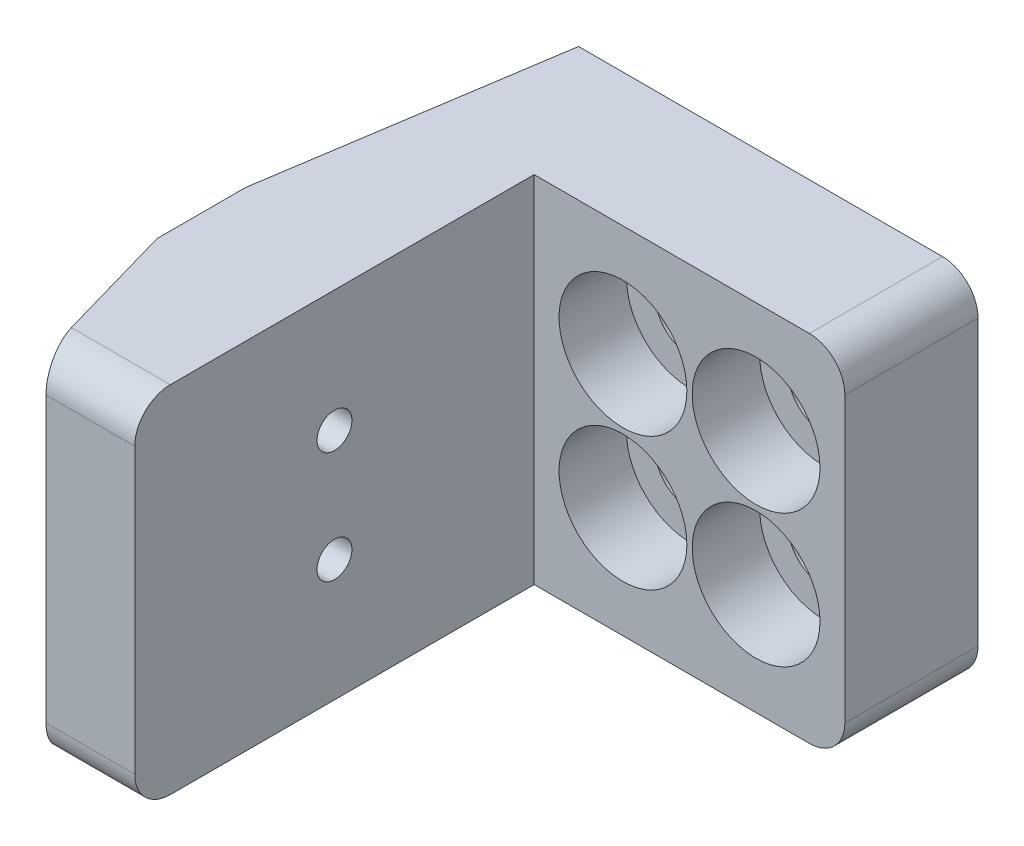
ISO-10303-21;
HEADER;
FILE_DESCRIPTION(('STEP AP214'),'2;1');
FILE_NAME('part.step','',(''),(''),'','','');
FILE_SCHEMA(('AUTOMOTIVE_DESIGN { 1 0 10303 214 1 1 1 1 }'));
ENDSEC;
DATA;
#1=APPLICATION_CONTEXT('core data for automotive mechanical design processes');
#2=APPLICATION_PROTOCOL_DEFINITION('international standard','automotive_design',2000,#1);
#3=PRODUCT_CONTEXT('',#1,'mechanical');
#4=PRODUCT('Part','Part','',(#3));
#5=PRODUCT_RELATED_PRODUCT_CATEGORY('part','',(#4));
#6=PRODUCT_DEFINITION_FORMATION('','',#4);
#7=PRODUCT_DEFINITION_CONTEXT('part definition',#1,'design');
#8=PRODUCT_DEFINITION('design','',#6,#7);
#9=PRODUCT_DEFINITION_SHAPE('','',#8);
#10=(LENGTH_UNIT() NAMED_UNIT(*) SI_UNIT(.MILLI.,.METRE.));
#11=(NAMED_UNIT(*) PLANE_ANGLE_UNIT() SI_UNIT($,.RADIAN.));
#12=(NAMED_UNIT(*) SI_UNIT($,.STERADIAN.) SOLID_ANGLE_UNIT());
#13=UNCERTAINTY_MEASURE_WITH_UNIT(LENGTH_MEASURE(1.E-05),#10,'distance_accuracy_value','');
#14=(GEOMETRIC_REPRESENTATION_CONTEXT(3) GLOBAL_UNCERTAINTY_ASSIGNED_CONTEXT((#13)) GLOBAL_UNIT_ASSIGNED_CONTEXT((#10,
#11,#12)) REPRESENTATION_CONTEXT('',''));
#15=CARTESIAN_POINT('',(0.,0.,0.));
#16=DIRECTION('',(0.,0.,1.));
#17=DIRECTION('',(1.,0.,0.));
#18=AXIS2_PLACEMENT_3D('',#15,#16,#17);
#19=CARTESIAN_POINT('',(0.,25.4,28.575));
#20=DIRECTION('',(-1.,0.,0.));
#21=DIRECTION('',(0.,0.,1.));
#22=AXIS2_PLACEMENT_3D('',#19,#20,#21);
#23=PLANE('',#22);
#24=CARTESIAN_POINT('',(0.,16.7,14.2875));
#25=DIRECTION('',(1.,0.,0.));
#26=DIRECTION('',(0.,0.,-1.));
#27=AXIS2_PLACEMENT_3D('',#24,#25,#26);
#28=CIRCLE('',#27,1.25);
#29=CARTESIAN_POINT('',(0.,16.7,13.0375));
#30=VERTEX_POINT('',#29);
#31=EDGE_CURVE('E374',#30,#30,#28,.T.);
#32=ORIENTED_EDGE('',*,*,#31,.F.);
#33=EDGE_LOOP('',(#32));
#34=FACE_BOUND('',#33,.T.);
#35=CARTESIAN_POINT('',(0.,8.7,14.2875));
#36=DIRECTION('',(1.,0.,0.));
#37=DIRECTION('',(0.,0.,-1.));
#38=AXIS2_PLACEMENT_3D('',#35,#36,#37);
#39=CIRCLE('',#38,1.25);
#40=CARTESIAN_POINT('',(0.,8.7,13.0375));
#41=VERTEX_POINT('',#40);
#42=EDGE_CURVE('E368',#41,#41,#39,.T.);
#43=ORIENTED_EDGE('',*,*,#42,.F.);
#44=EDGE_LOOP('',(#43));
#45=FACE_BOUND('',#44,.T.);
#46=DIRECTION('',(0.,-1.,0.));
#47=VECTOR('',#46,1.);
#48=CARTESIAN_POINT('',(0.,25.4,28.575));
#49=LINE('',#48,#47);
#50=CARTESIAN_POINT('',(0.,22.86,28.575));
#51=VERTEX_POINT('',#50);
#52=CARTESIAN_POINT('',(0.,2.54,28.575));
#53=VERTEX_POINT('',#52);
#54=EDGE_CURVE('E226',#51,#53,#49,.T.);
#55=ORIENTED_EDGE('',*,*,#54,.T.);
#56=CARTESIAN_POINT('',(0.,2.54,26.035));
#57=DIRECTION('',(-1.,0.,0.));
#58=DIRECTION('',(0.,0.,1.));
#59=AXIS2_PLACEMENT_3D('',#56,#57,#58);
#60=CIRCLE('',#59,2.54);
#61=CARTESIAN_POINT('',(0.,0.,26.035));
#62=VERTEX_POINT('',#61);
#63=EDGE_CURVE('E175',#53,#62,#60,.F.);
#64=ORIENTED_EDGE('',*,*,#63,.T.);
#65=DIRECTION('',(0.,0.,-1.));
#66=VECTOR('',#65,1.);
#67=CARTESIAN_POINT('',(0.,0.,28.575));
#68=LINE('',#67,#66);
#69=CARTESIAN_POINT('',(0.,0.,0.));
#70=VERTEX_POINT('',#69);
#71=EDGE_CURVE('E160',#62,#70,#68,.T.);
#72=ORIENTED_EDGE('',*,*,#71,.T.);
#73=DIRECTION('',(0.,-1.,0.));
#74=VECTOR('',#73,1.);
#75=CARTESIAN_POINT('',(0.,25.4,0.));
#76=LINE('',#75,#74);
#77=CARTESIAN_POINT('',(0.,25.4,0.));
#78=VERTEX_POINT('',#77);
#79=EDGE_CURVE('E154',#78,#70,#76,.T.);
#80=ORIENTED_EDGE('',*,*,#79,.F.);
#81=DIRECTION('',(0.,0.,-1.));
#82=VECTOR('',#81,1.);
#83=CARTESIAN_POINT('',(0.,25.4,28.575));
#84=LINE('',#83,#82);
#85=CARTESIAN_POINT('',(0.,25.4,26.035));
#86=VERTEX_POINT('',#85);
#87=EDGE_CURVE('E139',#86,#78,#84,.T.);
#88=ORIENTED_EDGE('',*,*,#87,.F.);
#89=CARTESIAN_POINT('',(0.,22.86,26.035));
#90=DIRECTION('',(-1.,0.,0.));
#91=DIRECTION('',(0.,0.,1.));
#92=AXIS2_PLACEMENT_3D('',#89,#90,#91);
#93=CIRCLE('',#92,2.54);
#94=EDGE_CURVE('E173',#86,#51,#93,.F.);
#95=ORIENTED_EDGE('',*,*,#94,.T.);
#96=EDGE_LOOP('',(#55,#64,#72,#80,#88,#95));
#97=FACE_BOUND('',#96,.T.);
#98=ADVANCED_FACE('F49',(#34,#45,#97),#23,.F.);
#99=CARTESIAN_POINT('',(0.,25.4,0.));
#100=DIRECTION('',(0.,0.,-1.));
#101=DIRECTION('',(-1.,0.,0.));
#102=AXIS2_PLACEMENT_3D('',#99,#100,#101);
#103=PLANE('',#102);
#104=CARTESIAN_POINT('',(6.35,17.4625,0.));
#105=DIRECTION('',(0.,0.,1.));
#106=DIRECTION('',(1.,0.,0.));
#107=AXIS2_PLACEMENT_3D('',#104,#105,#106);
#108=CIRCLE('',#107,4.572);
#109=CARTESIAN_POINT('',(10.922,17.4625,0.));
#110=VERTEX_POINT('',#109);
#111=EDGE_CURVE('E371',#110,#110,#108,.T.);
#112=ORIENTED_EDGE('',*,*,#111,.F.);
#113=EDGE_LOOP('',(#112));
#114=FACE_BOUND('',#113,.T.);
#115=CARTESIAN_POINT('',(15.875,7.9375,0.));
#116=DIRECTION('',(0.,0.,1.));
#117=DIRECTION('',(1.,0.,0.));
#118=AXIS2_PLACEMENT_3D('',#115,#116,#117);
#119=CIRCLE('',#118,4.572);
#120=CARTESIAN_POINT('',(20.447,7.9375,0.));
#121=VERTEX_POINT('',#120);
#122=EDGE_CURVE('E389',#121,#121,#119,.T.);
#123=ORIENTED_EDGE('',*,*,#122,.F.);
#124=EDGE_LOOP('',(#123));
#125=FACE_BOUND('',#124,.T.);
#126=CARTESIAN_POINT('',(6.35,7.9375,0.));
#127=DIRECTION('',(0.,0.,1.));
#128=DIRECTION('',(1.,0.,0.));
#129=AXIS2_PLACEMENT_3D('',#126,#127,#128);
#130=CIRCLE('',#129,4.572);
#131=CARTESIAN_POINT('',(10.922,7.9375,0.));
#132=VERTEX_POINT('',#131);
#133=EDGE_CURVE('E401',#132,#132,#130,.T.);
#134=ORIENTED_EDGE('',*,*,#133,.F.);
#135=EDGE_LOOP('',(#134));
#136=FACE_BOUND('',#135,.T.);
#137=CARTESIAN_POINT('',(15.875,17.4625,0.));
#138=DIRECTION('',(0.,0.,1.));
#139=DIRECTION('',(1.,0.,0.));
#140=AXIS2_PLACEMENT_3D('',#137,#138,#139);
#141=CIRCLE('',#140,4.572);
#142=CARTESIAN_POINT('',(20.447,17.4625,0.));
#143=VERTEX_POINT('',#142);
#144=EDGE_CURVE('E413',#143,#143,#141,.T.);
#145=ORIENTED_EDGE('',*,*,#144,.F.);
#146=EDGE_LOOP('',(#145));
#147=FACE_BOUND('',#146,.T.);
#148=DIRECTION('',(1.,0.,0.));
#149=VECTOR('',#148,1.);
#150=CARTESIAN_POINT('',(0.,0.,0.));
#151=LINE('',#150,#149);
#152=CARTESIAN_POINT('',(19.685,0.,0.));
#153=VERTEX_POINT('',#152);
#154=EDGE_CURVE('E210',#70,#153,#151,.T.);
#155=ORIENTED_EDGE('',*,*,#154,.T.);
#156=CARTESIAN_POINT('',(19.685,2.54,0.));
#157=DIRECTION('',(0.,0.,-1.));
#158=DIRECTION('',(-1.,0.,0.));
#159=AXIS2_PLACEMENT_3D('',#156,#157,#158);
#160=CIRCLE('',#159,2.54);
#161=CARTESIAN_POINT('',(22.225,2.54,0.));
#162=VERTEX_POINT('',#161);
#163=EDGE_CURVE('E11',#153,#162,#160,.F.);
#164=ORIENTED_EDGE('',*,*,#163,.T.);
#165=DIRECTION('',(0.,-1.,0.));
#166=VECTOR('',#165,1.);
#167=CARTESIAN_POINT('',(22.225,25.4,0.));
#168=LINE('',#167,#166);
#169=CARTESIAN_POINT('',(22.225,22.86,0.));
#170=VERTEX_POINT('',#169);
#171=EDGE_CURVE('E163',#170,#162,#168,.T.);
#172=ORIENTED_EDGE('',*,*,#171,.F.);
#173=CARTESIAN_POINT('',(19.685,22.86,0.));
#174=DIRECTION('',(0.,0.,-1.));
#175=DIRECTION('',(-1.,0.,0.));
#176=AXIS2_PLACEMENT_3D('',#173,#174,#175);
#177=CIRCLE('',#176,2.54);
#178=CARTESIAN_POINT('',(19.685,25.4,0.));
#179=VERTEX_POINT('',#178);
#180=EDGE_CURVE('E57',#170,#179,#177,.F.);
#181=ORIENTED_EDGE('',*,*,#180,.T.);
#182=DIRECTION('',(1.,0.,0.));
#183=VECTOR('',#182,1.);
#184=CARTESIAN_POINT('',(0.,25.4,0.));
#185=LINE('',#184,#183);
#186=EDGE_CURVE('E144',#78,#179,#185,.T.);
#187=ORIENTED_EDGE('',*,*,#186,.F.);
#188=ORIENTED_EDGE('',*,*,#79,.T.);
#189=EDGE_LOOP('',(#155,#164,#172,#181,#187,#188));
#190=FACE_BOUND('',#189,.T.);
#191=ADVANCED_FACE('F153',(#114,#125,#136,#147,#190),#103,.F.);
#192=CARTESIAN_POINT('',(22.225,25.4,0.));
#193=DIRECTION('',(-1.,0.,0.));
#194=DIRECTION('',(0.,0.,1.));
#195=AXIS2_PLACEMENT_3D('',#192,#193,#194);
#196=PLANE('',#195);
#197=ORIENTED_EDGE('',*,*,#171,.T.);
#198=DIRECTION('',(0.,0.,-1.));
#199=VECTOR('',#198,1.);
#200=CARTESIAN_POINT('',(22.225,2.54,-9.525));
#201=LINE('',#200,#199);
#202=CARTESIAN_POINT('',(22.225,2.54,-9.525));
#203=VERTEX_POINT('',#202);
#204=EDGE_CURVE('E189',#162,#203,#201,.T.);
#205=ORIENTED_EDGE('',*,*,#204,.T.);
#206=DIRECTION('',(0.,-1.,0.));
#207=VECTOR('',#206,1.);
#208=CARTESIAN_POINT('',(22.225,25.4,-9.525));
#209=LINE('',#208,#207);
#210=CARTESIAN_POINT('',(22.225,22.86,-9.525));
#211=VERTEX_POINT('',#210);
#212=EDGE_CURVE('E167',#211,#203,#209,.T.);
#213=ORIENTED_EDGE('',*,*,#212,.F.);
#214=DIRECTION('',(0.,0.,-1.));
#215=VECTOR('',#214,1.);
#216=CARTESIAN_POINT('',(22.225,22.86,0.));
#217=LINE('',#216,#215);
#218=EDGE_CURVE('E69',#211,#170,#217,.F.);
#219=ORIENTED_EDGE('',*,*,#218,.T.);
#220=EDGE_LOOP('',(#197,#205,#213,#219));
#221=FACE_BOUND('',#220,.T.);
#222=ADVANCED_FACE('F213',(#221),#196,.F.);
#223=CARTESIAN_POINT('',(22.225,25.4,-9.525));
#224=DIRECTION('',(0.,0.,1.));
#225=DIRECTION('',(1.,0.,0.));
#226=AXIS2_PLACEMENT_3D('',#223,#224,#225);
#227=PLANE('',#226);
#228=CARTESIAN_POINT('',(6.35,17.4625,-9.525));
#229=DIRECTION('',(0.,0.,1.));
#230=DIRECTION('',(1.,0.,0.));
#231=AXIS2_PLACEMENT_3D('',#228,#229,#230);
#232=CIRCLE('',#231,2.5527);
#233=CARTESIAN_POINT('',(8.9027,17.4625,-9.525));
#234=VERTEX_POINT('',#233);
#235=EDGE_CURVE('E386',#234,#234,#232,.T.);
#236=ORIENTED_EDGE('',*,*,#235,.T.);
#237=EDGE_LOOP('',(#236));
#238=FACE_BOUND('',#237,.T.);
#239=CARTESIAN_POINT('',(15.875,7.9375,-9.525));
#240=DIRECTION('',(0.,0.,1.));
#241=DIRECTION('',(1.,0.,0.));
#242=AXIS2_PLACEMENT_3D('',#239,#240,#241);
#243=CIRCLE('',#242,2.5527);
#244=CARTESIAN_POINT('',(18.4277,7.9375,-9.525));
#245=VERTEX_POINT('',#244);
#246=EDGE_CURVE('E398',#245,#245,#243,.T.);
#247=ORIENTED_EDGE('',*,*,#246,.T.);
#248=EDGE_LOOP('',(#247));
#249=FACE_BOUND('',#248,.T.);
#250=CARTESIAN_POINT('',(6.35,7.9375,-9.525));
#251=DIRECTION('',(0.,0.,1.));
#252=DIRECTION('',(1.,0.,0.));
#253=AXIS2_PLACEMENT_3D('',#250,#251,#252);
#254=CIRCLE('',#253,2.5527);
#255=CARTESIAN_POINT('',(8.9027,7.9375,-9.525));
#256=VERTEX_POINT('',#255);
#257=EDGE_CURVE('E410',#256,#256,#254,.T.);
#258=ORIENTED_EDGE('',*,*,#257,.T.);
#259=EDGE_LOOP('',(#258));
#260=FACE_BOUND('',#259,.T.);
#261=CARTESIAN_POINT('',(15.875,17.4625,-9.525));
#262=DIRECTION('',(0.,0.,1.));
#263=DIRECTION('',(1.,0.,0.));
#264=AXIS2_PLACEMENT_3D('',#261,#262,#263);
#265=CIRCLE('',#264,2.5527);
#266=CARTESIAN_POINT('',(18.4277,17.4625,-9.525));
#267=VERTEX_POINT('',#266);
#268=EDGE_CURVE('E228',#267,#267,#265,.T.);
#269=ORIENTED_EDGE('',*,*,#268,.T.);
#270=EDGE_LOOP('',(#269));
#271=FACE_BOUND('',#270,.T.);
#272=ORIENTED_EDGE('',*,*,#212,.T.);
#273=CARTESIAN_POINT('',(19.685,2.54,-9.525));
#274=DIRECTION('',(0.,0.,1.));
#275=DIRECTION('',(1.,0.,0.));
#276=AXIS2_PLACEMENT_3D('',#273,#274,#275);
#277=CIRCLE('',#276,2.54);
#278=CARTESIAN_POINT('',(19.685,0.,-9.525));
#279=VERTEX_POINT('',#278);
#280=EDGE_CURVE('E194',#203,#279,#277,.F.);
#281=ORIENTED_EDGE('',*,*,#280,.T.);
#282=DIRECTION('',(-1.,0.,0.));
#283=VECTOR('',#282,1.);
#284=CARTESIAN_POINT('',(22.225,0.,-9.525));
#285=LINE('',#284,#283);
#286=CARTESIAN_POINT('',(-6.35,0.,-9.525));
#287=VERTEX_POINT('',#286);
#288=EDGE_CURVE('E200',#279,#287,#285,.T.);
#289=ORIENTED_EDGE('',*,*,#288,.T.);
#290=DIRECTION('',(0.,-1.,0.));
#291=VECTOR('',#290,1.);
#292=CARTESIAN_POINT('',(-6.35,25.4,-9.525));
#293=LINE('',#292,#291);
#294=CARTESIAN_POINT('',(-6.35,25.4,-9.525));
#295=VERTEX_POINT('',#294);
#296=EDGE_CURVE('E216',#295,#287,#293,.T.);
#297=ORIENTED_EDGE('',*,*,#296,.F.);
#298=DIRECTION('',(-1.,0.,0.));
#299=VECTOR('',#298,1.);
#300=CARTESIAN_POINT('',(22.225,25.4,-9.525));
#301=LINE('',#300,#299);
#302=CARTESIAN_POINT('',(19.685,25.4,-9.525));
#303=VERTEX_POINT('',#302);
#304=EDGE_CURVE('E156',#303,#295,#301,.T.);
#305=ORIENTED_EDGE('',*,*,#304,.F.);
#306=CARTESIAN_POINT('',(19.685,22.86,-9.525));
#307=DIRECTION('',(0.,0.,1.));
#308=DIRECTION('',(1.,0.,0.));
#309=AXIS2_PLACEMENT_3D('',#306,#307,#308);
#310=CIRCLE('',#309,2.54);
#311=EDGE_CURVE('E192',#303,#211,#310,.F.);
#312=ORIENTED_EDGE('',*,*,#311,.T.);
#313=EDGE_LOOP('',(#272,#281,#289,#297,#305,#312));
#314=FACE_BOUND('',#313,.T.);
#315=ADVANCED_FACE('F198',(#238,#249,#260,#271,#314),#227,.F.);
#316=CARTESIAN_POINT('',(-9.525,25.4,11.1125));
#317=DIRECTION('',(0.988371697650617,0.,0.152057184253941));
#318=DIRECTION('',(0.152057184253941,0.,-0.988371697650617));
#319=AXIS2_PLACEMENT_3D('',#316,#317,#318);
#320=PLANE('',#319);
#321=DIRECTION('',(-0.152057184253941,0.,0.988371697650617));
#322=VECTOR('',#321,1.);
#323=CARTESIAN_POINT('',(-9.525,0.,11.1125));
#324=LINE('',#323,#322);
#325=CARTESIAN_POINT('',(-9.525,0.,11.1125));
#326=VERTEX_POINT('',#325);
#327=EDGE_CURVE('E209',#287,#326,#324,.T.);
#328=ORIENTED_EDGE('',*,*,#327,.T.);
#329=DIRECTION('',(0.,-1.,0.));
#330=VECTOR('',#329,1.);
#331=CARTESIAN_POINT('',(-9.525,25.4,11.1125));
#332=LINE('',#331,#330);
#333=CARTESIAN_POINT('',(-9.525,25.4,11.1125));
#334=VERTEX_POINT('',#333);
#335=EDGE_CURVE('E242',#334,#326,#332,.T.);
#336=ORIENTED_EDGE('',*,*,#335,.F.);
#337=DIRECTION('',(-0.152057184253941,0.,0.988371697650617));
#338=VECTOR('',#337,1.);
#339=CARTESIAN_POINT('',(-9.525,25.4,11.1125));
#340=LINE('',#339,#338);
#341=EDGE_CURVE('E218',#295,#334,#340,.T.);
#342=ORIENTED_EDGE('',*,*,#341,.F.);
#343=ORIENTED_EDGE('',*,*,#296,.T.);
#344=EDGE_LOOP('',(#328,#336,#342,#343));
#345=FACE_BOUND('',#344,.T.);
#346=ADVANCED_FACE('F246',(#345),#320,.F.);
#347=CARTESIAN_POINT('',(-9.525,25.4,11.1125));
#348=DIRECTION('',(1.,0.,0.));
#349=DIRECTION('',(0.,0.,-1.));
#350=AXIS2_PLACEMENT_3D('',#347,#348,#349);
#351=PLANE('',#350);
#352=CARTESIAN_POINT('',(-9.525,16.7,14.2875));
#353=DIRECTION('',(1.,0.,0.));
#354=DIRECTION('',(0.,0.,-1.));
#355=AXIS2_PLACEMENT_3D('',#352,#353,#354);
#356=CIRCLE('',#355,1.25);
#357=CARTESIAN_POINT('',(-9.525,16.7,13.0375));
#358=VERTEX_POINT('',#357);
#359=EDGE_CURVE('E369',#358,#358,#356,.T.);
#360=ORIENTED_EDGE('',*,*,#359,.T.);
#361=EDGE_LOOP('',(#360));
#362=FACE_BOUND('',#361,.T.);
#363=CARTESIAN_POINT('',(-9.525,8.7,14.2875));
#364=DIRECTION('',(1.,0.,0.));
#365=DIRECTION('',(0.,0.,-1.));
#366=AXIS2_PLACEMENT_3D('',#363,#364,#365);
#367=CIRCLE('',#366,1.25);
#368=CARTESIAN_POINT('',(-9.525,8.7,13.0375));
#369=VERTEX_POINT('',#368);
#370=EDGE_CURVE('E365',#369,#369,#367,.T.);
#371=ORIENTED_EDGE('',*,*,#370,.T.);
#372=EDGE_LOOP('',(#371));
#373=FACE_BOUND('',#372,.T.);
#374=DIRECTION('',(0.,0.,1.));
#375=VECTOR('',#374,1.);
#376=CARTESIAN_POINT('',(-9.525,0.,11.1125));
#377=LINE('',#376,#375);
#378=CARTESIAN_POINT('',(-9.525,0.,17.4625));
#379=VERTEX_POINT('',#378);
#380=EDGE_CURVE('E231',#326,#379,#377,.T.);
#381=ORIENTED_EDGE('',*,*,#380,.T.);
#382=DIRECTION('',(0.,-1.,0.));
#383=VECTOR('',#382,1.);
#384=CARTESIAN_POINT('',(-9.525,25.4,17.4625));
#385=LINE('',#384,#383);
#386=CARTESIAN_POINT('',(-9.525,25.4,17.4625));
#387=VERTEX_POINT('',#386);
#388=EDGE_CURVE('E239',#387,#379,#385,.T.);
#389=ORIENTED_EDGE('',*,*,#388,.F.);
#390=DIRECTION('',(0.,0.,1.));
#391=VECTOR('',#390,1.);
#392=CARTESIAN_POINT('',(-9.525,25.4,11.1125));
#393=LINE('',#392,#391);
#394=EDGE_CURVE('E220',#334,#387,#393,.T.);
#395=ORIENTED_EDGE('',*,*,#394,.F.);
#396=ORIENTED_EDGE('',*,*,#335,.T.);
#397=EDGE_LOOP('',(#381,#389,#395,#396));
#398=FACE_BOUND('',#397,.T.);
#399=ADVANCED_FACE('F252',(#362,#373,#398),#351,.F.);
#400=CARTESIAN_POINT('',(-9.525,25.4,17.4625));
#401=DIRECTION('',(0.961523947640823,0.,-0.274721127897378));
#402=DIRECTION('',(-0.274721127897378,0.,-0.961523947640823));
#403=AXIS2_PLACEMENT_3D('',#400,#401,#402);
#404=PLANE('',#403);
#405=DIRECTION('',(0.274721127897378,0.,0.961523947640823));
#406=VECTOR('',#405,1.);
#407=CARTESIAN_POINT('',(-9.525,0.,17.4625));
#408=LINE('',#407,#406);
#409=CARTESIAN_POINT('',(-7.07571428571428,0.,26.035));
#410=VERTEX_POINT('',#409);
#411=EDGE_CURVE('E150',#379,#410,#408,.T.);
#412=ORIENTED_EDGE('',*,*,#411,.T.);
#413=CARTESIAN_POINT('',(-7.07571428571428,2.54,26.035));
#414=DIRECTION('',(0.961523947640823,0.,-0.274721127897378));
#415=DIRECTION('',(-0.274721127897378,0.,-0.961523947640823));
#416=AXIS2_PLACEMENT_3D('',#413,#414,#415);
#417=ELLIPSE('',#416,2.64163987411036,2.54);
#418=CARTESIAN_POINT('',(-6.35,2.54,28.575));
#419=VERTEX_POINT('',#418);
#420=EDGE_CURVE('E183',#410,#419,#417,.F.);
#421=ORIENTED_EDGE('',*,*,#420,.T.);
#422=DIRECTION('',(0.,-1.,0.));
#423=VECTOR('',#422,1.);
#424=CARTESIAN_POINT('',(-6.35,25.4,28.575));
#425=LINE('',#424,#423);
#426=CARTESIAN_POINT('',(-6.35,22.86,28.575));
#427=VERTEX_POINT('',#426);
#428=EDGE_CURVE('E236',#427,#419,#425,.T.);
#429=ORIENTED_EDGE('',*,*,#428,.F.);
#430=CARTESIAN_POINT('',(-7.07571428571428,22.86,26.035));
#431=DIRECTION('',(0.961523947640823,0.,-0.274721127897378));
#432=DIRECTION('',(0.274721127897378,0.,0.961523947640823));
#433=AXIS2_PLACEMENT_3D('',#430,#431,#432);
#434=ELLIPSE('',#433,2.64163987411036,2.54);
#435=CARTESIAN_POINT('',(-7.07571428571428,25.4,26.035));
#436=VERTEX_POINT('',#435);
#437=EDGE_CURVE('E181',#427,#436,#434,.F.);
#438=ORIENTED_EDGE('',*,*,#437,.T.);
#439=DIRECTION('',(0.274721127897378,0.,0.961523947640823));
#440=VECTOR('',#439,1.);
#441=CARTESIAN_POINT('',(-9.525,25.4,17.4625));
#442=LINE('',#441,#440);
#443=EDGE_CURVE('E224',#387,#436,#442,.T.);
#444=ORIENTED_EDGE('',*,*,#443,.F.);
#445=ORIENTED_EDGE('',*,*,#388,.T.);
#446=EDGE_LOOP('',(#412,#421,#429,#438,#444,#445));
#447=FACE_BOUND('',#446,.T.);
#448=ADVANCED_FACE('F255',(#447),#404,.F.);
#449=CARTESIAN_POINT('',(-6.35,25.4,28.575));
#450=DIRECTION('',(0.,0.,-1.));
#451=DIRECTION('',(-1.,0.,0.));
#452=AXIS2_PLACEMENT_3D('',#449,#450,#451);
#453=PLANE('',#452);
#454=ORIENTED_EDGE('',*,*,#428,.T.);
#455=DIRECTION('',(1.,0.,0.));
#456=VECTOR('',#455,1.);
#457=CARTESIAN_POINT('',(0.,2.54,28.575));
#458=LINE('',#457,#456);
#459=EDGE_CURVE('E165',#419,#53,#458,.T.);
#460=ORIENTED_EDGE('',*,*,#459,.T.);
#461=ORIENTED_EDGE('',*,*,#54,.F.);
#462=DIRECTION('',(1.,0.,0.));
#463=VECTOR('',#462,1.);
#464=CARTESIAN_POINT('',(-6.35,22.86,28.575));
#465=LINE('',#464,#463);
#466=EDGE_CURVE('E162',#51,#427,#465,.F.);
#467=ORIENTED_EDGE('',*,*,#466,.T.);
#468=EDGE_LOOP('',(#454,#460,#461,#467));
#469=FACE_BOUND('',#468,.T.);
#470=ADVANCED_FACE('F263',(#469),#453,.F.);
#471=CARTESIAN_POINT('',(0.,25.4,0.));
#472=DIRECTION('',(0.,-1.,0.));
#473=DIRECTION('',(0.,0.,-1.));
#474=AXIS2_PLACEMENT_3D('',#471,#472,#473);
#475=PLANE('',#474);
#476=ORIENTED_EDGE('',*,*,#443,.T.);
#477=DIRECTION('',(1.,0.,0.));
#478=VECTOR('',#477,1.);
#479=CARTESIAN_POINT('',(0.,25.4,26.035));
#480=LINE('',#479,#478);
#481=EDGE_CURVE('E147',#436,#86,#480,.T.);
#482=ORIENTED_EDGE('',*,*,#481,.T.);
#483=ORIENTED_EDGE('',*,*,#87,.T.);
#484=ORIENTED_EDGE('',*,*,#186,.T.);
#485=DIRECTION('',(0.,0.,-1.));
#486=VECTOR('',#485,1.);
#487=CARTESIAN_POINT('',(19.685,25.4,0.));
#488=LINE('',#487,#486);
#489=EDGE_CURVE('E185',#179,#303,#488,.T.);
#490=ORIENTED_EDGE('',*,*,#489,.T.);
#491=ORIENTED_EDGE('',*,*,#304,.T.);
#492=ORIENTED_EDGE('',*,*,#341,.T.);
#493=ORIENTED_EDGE('',*,*,#394,.T.);
#494=EDGE_LOOP('',(#476,#482,#483,#484,#490,#491,#492,#493));
#495=FACE_BOUND('',#494,.T.);
#496=ADVANCED_FACE('F142',(#495),#475,.F.);
#497=CARTESIAN_POINT('',(0.,0.,0.));
#498=DIRECTION('',(0.,-1.,0.));
#499=DIRECTION('',(0.,0.,-1.));
#500=AXIS2_PLACEMENT_3D('',#497,#498,#499);
#501=PLANE('',#500);
#502=ORIENTED_EDGE('',*,*,#71,.F.);
#503=DIRECTION('',(1.,0.,0.));
#504=VECTOR('',#503,1.);
#505=CARTESIAN_POINT('',(-6.35,0.,26.035));
#506=LINE('',#505,#504);
#507=EDGE_CURVE('E179',#62,#410,#506,.F.);
#508=ORIENTED_EDGE('',*,*,#507,.T.);
#509=ORIENTED_EDGE('',*,*,#411,.F.);
#510=ORIENTED_EDGE('',*,*,#380,.F.);
#511=ORIENTED_EDGE('',*,*,#327,.F.);
#512=ORIENTED_EDGE('',*,*,#288,.F.);
#513=DIRECTION('',(0.,0.,-1.));
#514=VECTOR('',#513,1.);
#515=CARTESIAN_POINT('',(19.685,0.,0.));
#516=LINE('',#515,#514);
#517=EDGE_CURVE('E177',#279,#153,#516,.F.);
#518=ORIENTED_EDGE('',*,*,#517,.T.);
#519=ORIENTED_EDGE('',*,*,#154,.F.);
#520=EDGE_LOOP('',(#502,#508,#509,#510,#511,#512,#518,#519));
#521=FACE_BOUND('',#520,.T.);
#522=ADVANCED_FACE('F207',(#521),#501,.T.);
#523=CARTESIAN_POINT('',(15.875,17.4625,0.));
#524=DIRECTION('',(0.,0.,1.));
#525=DIRECTION('',(1.,0.,0.));
#526=AXIS2_PLACEMENT_3D('',#523,#524,#525);
#527=CYLINDRICAL_SURFACE('',#526,2.5527);
#528=ORIENTED_EDGE('',*,*,#268,.F.);
#529=EDGE_LOOP('',(#528));
#530=FACE_BOUND('',#529,.T.);
#531=CARTESIAN_POINT('',(15.875,17.4625,-4.826));
#532=DIRECTION('',(0.,0.,1.));
#533=DIRECTION('',(1.,0.,0.));
#534=AXIS2_PLACEMENT_3D('',#531,#532,#533);
#535=CIRCLE('',#534,2.5527);
#536=CARTESIAN_POINT('',(18.4277,17.4625,-4.826));
#537=VERTEX_POINT('',#536);
#538=EDGE_CURVE('E419',#537,#537,#535,.T.);
#539=ORIENTED_EDGE('',*,*,#538,.T.);
#540=EDGE_LOOP('',(#539));
#541=FACE_BOUND('',#540,.T.);
#542=ADVANCED_FACE('F308',(#530,#541),#527,.F.);
#543=CARTESIAN_POINT('',(18.4277,17.4625,-4.826));
#544=DIRECTION('',(0.,0.,-1.));
#545=DIRECTION('',(-1.,0.,0.));
#546=AXIS2_PLACEMENT_3D('',#543,#544,#545);
#547=PLANE('',#546);
#548=ORIENTED_EDGE('',*,*,#538,.F.);
#549=EDGE_LOOP('',(#548));
#550=FACE_BOUND('',#549,.T.);
#551=CARTESIAN_POINT('',(15.875,17.4625,-4.826));
#552=DIRECTION('',(0.,0.,1.));
#553=DIRECTION('',(1.,0.,0.));
#554=AXIS2_PLACEMENT_3D('',#551,#552,#553);
#555=CIRCLE('',#554,4.572);
#556=CARTESIAN_POINT('',(20.447,17.4625,-4.826));
#557=VERTEX_POINT('',#556);
#558=EDGE_CURVE('E416',#557,#557,#555,.T.);
#559=ORIENTED_EDGE('',*,*,#558,.T.);
#560=EDGE_LOOP('',(#559));
#561=FACE_BOUND('',#560,.T.);
#562=ADVANCED_FACE('F313',(#550,#561),#547,.F.);
#563=CARTESIAN_POINT('',(15.875,17.4625,0.));
#564=DIRECTION('',(0.,0.,1.));
#565=DIRECTION('',(1.,0.,0.));
#566=AXIS2_PLACEMENT_3D('',#563,#564,#565);
#567=CYLINDRICAL_SURFACE('',#566,4.572);
#568=ORIENTED_EDGE('',*,*,#558,.F.);
#569=EDGE_LOOP('',(#568));
#570=FACE_BOUND('',#569,.T.);
#571=ORIENTED_EDGE('',*,*,#144,.T.);
#572=EDGE_LOOP('',(#571));
#573=FACE_BOUND('',#572,.T.);
#574=ADVANCED_FACE('F317',(#570,#573),#567,.F.);
#575=CARTESIAN_POINT('',(6.35,7.9375,0.));
#576=DIRECTION('',(0.,0.,1.));
#577=DIRECTION('',(1.,0.,0.));
#578=AXIS2_PLACEMENT_3D('',#575,#576,#577);
#579=CYLINDRICAL_SURFACE('',#578,2.5527);
#580=ORIENTED_EDGE('',*,*,#257,.F.);
#581=EDGE_LOOP('',(#580));
#582=FACE_BOUND('',#581,.T.);
#583=CARTESIAN_POINT('',(6.35,7.9375,-4.826));
#584=DIRECTION('',(0.,0.,1.));
#585=DIRECTION('',(1.,0.,0.));
#586=AXIS2_PLACEMENT_3D('',#583,#584,#585);
#587=CIRCLE('',#586,2.5527);
#588=CARTESIAN_POINT('',(8.9027,7.9375,-4.826));
#589=VERTEX_POINT('',#588);
#590=EDGE_CURVE('E407',#589,#589,#587,.T.);
#591=ORIENTED_EDGE('',*,*,#590,.T.);
#592=EDGE_LOOP('',(#591));
#593=FACE_BOUND('',#592,.T.);
#594=ADVANCED_FACE('F321',(#582,#593),#579,.F.);
#595=CARTESIAN_POINT('',(8.9027,7.9375,-4.826));
#596=DIRECTION('',(0.,0.,-1.));
#597=DIRECTION('',(-1.,0.,0.));
#598=AXIS2_PLACEMENT_3D('',#595,#596,#597);
#599=PLANE('',#598);
#600=ORIENTED_EDGE('',*,*,#590,.F.);
#601=EDGE_LOOP('',(#600));
#602=FACE_BOUND('',#601,.T.);
#603=CARTESIAN_POINT('',(6.35,7.9375,-4.826));
#604=DIRECTION('',(0.,0.,1.));
#605=DIRECTION('',(1.,0.,0.));
#606=AXIS2_PLACEMENT_3D('',#603,#604,#605);
#607=CIRCLE('',#606,4.572);
#608=CARTESIAN_POINT('',(10.922,7.9375,-4.826));
#609=VERTEX_POINT('',#608);
#610=EDGE_CURVE('E404',#609,#609,#607,.T.);
#611=ORIENTED_EDGE('',*,*,#610,.T.);
#612=EDGE_LOOP('',(#611));
#613=FACE_BOUND('',#612,.T.);
#614=ADVANCED_FACE('F325',(#602,#613),#599,.F.);
#615=CARTESIAN_POINT('',(6.35,7.9375,0.));
#616=DIRECTION('',(0.,0.,1.));
#617=DIRECTION('',(1.,0.,0.));
#618=AXIS2_PLACEMENT_3D('',#615,#616,#617);
#619=CYLINDRICAL_SURFACE('',#618,4.572);
#620=ORIENTED_EDGE('',*,*,#610,.F.);
#621=EDGE_LOOP('',(#620));
#622=FACE_BOUND('',#621,.T.);
#623=ORIENTED_EDGE('',*,*,#133,.T.);
#624=EDGE_LOOP('',(#623));
#625=FACE_BOUND('',#624,.T.);
#626=ADVANCED_FACE('F329',(#622,#625),#619,.F.);
#627=CARTESIAN_POINT('',(15.875,7.9375,0.));
#628=DIRECTION('',(0.,0.,1.));
#629=DIRECTION('',(1.,0.,0.));
#630=AXIS2_PLACEMENT_3D('',#627,#628,#629);
#631=CYLINDRICAL_SURFACE('',#630,2.5527);
#632=ORIENTED_EDGE('',*,*,#246,.F.);
#633=EDGE_LOOP('',(#632));
#634=FACE_BOUND('',#633,.T.);
#635=CARTESIAN_POINT('',(15.875,7.9375,-4.826));
#636=DIRECTION('',(0.,0.,1.));
#637=DIRECTION('',(1.,0.,0.));
#638=AXIS2_PLACEMENT_3D('',#635,#636,#637);
#639=CIRCLE('',#638,2.5527);
#640=CARTESIAN_POINT('',(18.4277,7.9375,-4.826));
#641=VERTEX_POINT('',#640);
#642=EDGE_CURVE('E395',#641,#641,#639,.T.);
#643=ORIENTED_EDGE('',*,*,#642,.T.);
#644=EDGE_LOOP('',(#643));
#645=FACE_BOUND('',#644,.T.);
#646=ADVANCED_FACE('F333',(#634,#645),#631,.F.);
#647=CARTESIAN_POINT('',(18.4277,7.9375,-4.826));
#648=DIRECTION('',(0.,0.,-1.));
#649=DIRECTION('',(-1.,0.,0.));
#650=AXIS2_PLACEMENT_3D('',#647,#648,#649);
#651=PLANE('',#650);
#652=ORIENTED_EDGE('',*,*,#642,.F.);
#653=EDGE_LOOP('',(#652));
#654=FACE_BOUND('',#653,.T.);
#655=CARTESIAN_POINT('',(15.875,7.9375,-4.826));
#656=DIRECTION('',(0.,0.,1.));
#657=DIRECTION('',(1.,0.,0.));
#658=AXIS2_PLACEMENT_3D('',#655,#656,#657);
#659=CIRCLE('',#658,4.572);
#660=CARTESIAN_POINT('',(20.447,7.9375,-4.826));
#661=VERTEX_POINT('',#660);
#662=EDGE_CURVE('E392',#661,#661,#659,.T.);
#663=ORIENTED_EDGE('',*,*,#662,.T.);
#664=EDGE_LOOP('',(#663));
#665=FACE_BOUND('',#664,.T.);
#666=ADVANCED_FACE('F337',(#654,#665),#651,.F.);
#667=CARTESIAN_POINT('',(15.875,7.9375,0.));
#668=DIRECTION('',(0.,0.,1.));
#669=DIRECTION('',(1.,0.,0.));
#670=AXIS2_PLACEMENT_3D('',#667,#668,#669);
#671=CYLINDRICAL_SURFACE('',#670,4.572);
#672=ORIENTED_EDGE('',*,*,#662,.F.);
#673=EDGE_LOOP('',(#672));
#674=FACE_BOUND('',#673,.T.);
#675=ORIENTED_EDGE('',*,*,#122,.T.);
#676=EDGE_LOOP('',(#675));
#677=FACE_BOUND('',#676,.T.);
#678=ADVANCED_FACE('F341',(#674,#677),#671,.F.);
#679=CARTESIAN_POINT('',(6.35,17.4625,0.));
#680=DIRECTION('',(0.,0.,1.));
#681=DIRECTION('',(1.,0.,0.));
#682=AXIS2_PLACEMENT_3D('',#679,#680,#681);
#683=CYLINDRICAL_SURFACE('',#682,2.5527);
#684=ORIENTED_EDGE('',*,*,#235,.F.);
#685=EDGE_LOOP('',(#684));
#686=FACE_BOUND('',#685,.T.);
#687=CARTESIAN_POINT('',(6.35,17.4625,-4.826));
#688=DIRECTION('',(0.,0.,1.));
#689=DIRECTION('',(1.,0.,0.));
#690=AXIS2_PLACEMENT_3D('',#687,#688,#689);
#691=CIRCLE('',#690,2.5527);
#692=CARTESIAN_POINT('',(8.9027,17.4625,-4.826));
#693=VERTEX_POINT('',#692);
#694=EDGE_CURVE('E383',#693,#693,#691,.T.);
#695=ORIENTED_EDGE('',*,*,#694,.T.);
#696=EDGE_LOOP('',(#695));
#697=FACE_BOUND('',#696,.T.);
#698=ADVANCED_FACE('F345',(#686,#697),#683,.F.);
#699=CARTESIAN_POINT('',(8.9027,17.4625,-4.826));
#700=DIRECTION('',(0.,0.,-1.));
#701=DIRECTION('',(-1.,0.,0.));
#702=AXIS2_PLACEMENT_3D('',#699,#700,#701);
#703=PLANE('',#702);
#704=ORIENTED_EDGE('',*,*,#694,.F.);
#705=EDGE_LOOP('',(#704));
#706=FACE_BOUND('',#705,.T.);
#707=CARTESIAN_POINT('',(6.35,17.4625,-4.826));
#708=DIRECTION('',(0.,0.,1.));
#709=DIRECTION('',(1.,0.,0.));
#710=AXIS2_PLACEMENT_3D('',#707,#708,#709);
#711=CIRCLE('',#710,4.572);
#712=CARTESIAN_POINT('',(10.922,17.4625,-4.826));
#713=VERTEX_POINT('',#712);
#714=EDGE_CURVE('E380',#713,#713,#711,.T.);
#715=ORIENTED_EDGE('',*,*,#714,.T.);
#716=EDGE_LOOP('',(#715));
#717=FACE_BOUND('',#716,.T.);
#718=ADVANCED_FACE('F349',(#706,#717),#703,.F.);
#719=CARTESIAN_POINT('',(6.35,17.4625,0.));
#720=DIRECTION('',(0.,0.,1.));
#721=DIRECTION('',(1.,0.,0.));
#722=AXIS2_PLACEMENT_3D('',#719,#720,#721);
#723=CYLINDRICAL_SURFACE('',#722,4.572);
#724=ORIENTED_EDGE('',*,*,#714,.F.);
#725=EDGE_LOOP('',(#724));
#726=FACE_BOUND('',#725,.T.);
#727=ORIENTED_EDGE('',*,*,#111,.T.);
#728=EDGE_LOOP('',(#727));
#729=FACE_BOUND('',#728,.T.);
#730=ADVANCED_FACE('F353',(#726,#729),#723,.F.);
#731=CARTESIAN_POINT('',(0.,8.7,14.2875));
#732=DIRECTION('',(1.,0.,0.));
#733=DIRECTION('',(0.,0.,-1.));
#734=AXIS2_PLACEMENT_3D('',#731,#732,#733);
#735=CYLINDRICAL_SURFACE('',#734,1.25);
#736=ORIENTED_EDGE('',*,*,#370,.F.);
#737=EDGE_LOOP('',(#736));
#738=FACE_BOUND('',#737,.T.);
#739=ORIENTED_EDGE('',*,*,#42,.T.);
#740=EDGE_LOOP('',(#739));
#741=FACE_BOUND('',#740,.T.);
#742=ADVANCED_FACE('F278',(#738,#741),#735,.F.);
#743=CARTESIAN_POINT('',(0.,16.7,14.2875));
#744=DIRECTION('',(1.,0.,0.));
#745=DIRECTION('',(0.,0.,-1.));
#746=AXIS2_PLACEMENT_3D('',#743,#744,#745);
#747=CYLINDRICAL_SURFACE('',#746,1.25);
#748=ORIENTED_EDGE('',*,*,#359,.F.);
#749=EDGE_LOOP('',(#748));
#750=FACE_BOUND('',#749,.T.);
#751=ORIENTED_EDGE('',*,*,#31,.T.);
#752=EDGE_LOOP('',(#751));
#753=FACE_BOUND('',#752,.T.);
#754=ADVANCED_FACE('F270',(#750,#753),#747,.F.);
#755=CARTESIAN_POINT('',(-6.35,2.54,26.035));
#756=DIRECTION('',(-1.,0.,0.));
#757=DIRECTION('',(0.,0.,1.));
#758=AXIS2_PLACEMENT_3D('',#755,#756,#757);
#759=CYLINDRICAL_SURFACE('',#758,2.54);
#760=ORIENTED_EDGE('',*,*,#420,.F.);
#761=ORIENTED_EDGE('',*,*,#507,.F.);
#762=ORIENTED_EDGE('',*,*,#63,.F.);
#763=ORIENTED_EDGE('',*,*,#459,.F.);
#764=EDGE_LOOP('',(#760,#761,#762,#763));
#765=FACE_BOUND('',#764,.T.);
#766=ADVANCED_FACE('F267',(#765),#759,.T.);
#767=CARTESIAN_POINT('',(0.,22.86,26.035));
#768=DIRECTION('',(1.,0.,0.));
#769=DIRECTION('',(0.,0.,-1.));
#770=AXIS2_PLACEMENT_3D('',#767,#768,#769);
#771=CYLINDRICAL_SURFACE('',#770,2.54);
#772=ORIENTED_EDGE('',*,*,#437,.F.);
#773=ORIENTED_EDGE('',*,*,#466,.F.);
#774=ORIENTED_EDGE('',*,*,#94,.F.);
#775=ORIENTED_EDGE('',*,*,#481,.F.);
#776=EDGE_LOOP('',(#772,#773,#774,#775));
#777=FACE_BOUND('',#776,.T.);
#778=ADVANCED_FACE('F260',(#777),#771,.T.);
#779=CARTESIAN_POINT('',(19.685,2.54,0.));
#780=DIRECTION('',(0.,0.,1.));
#781=DIRECTION('',(1.,0.,0.));
#782=AXIS2_PLACEMENT_3D('',#779,#780,#781);
#783=CYLINDRICAL_SURFACE('',#782,2.54);
#784=ORIENTED_EDGE('',*,*,#163,.F.);
#785=ORIENTED_EDGE('',*,*,#517,.F.);
#786=ORIENTED_EDGE('',*,*,#280,.F.);
#787=ORIENTED_EDGE('',*,*,#204,.F.);
#788=EDGE_LOOP('',(#784,#785,#786,#787));
#789=FACE_BOUND('',#788,.T.);
#790=ADVANCED_FACE('F212',(#789),#783,.T.);
#791=CARTESIAN_POINT('',(19.685,22.86,0.));
#792=DIRECTION('',(0.,0.,-1.));
#793=DIRECTION('',(-1.,0.,0.));
#794=AXIS2_PLACEMENT_3D('',#791,#792,#793);
#795=CYLINDRICAL_SURFACE('',#794,2.54);
#796=ORIENTED_EDGE('',*,*,#180,.F.);
#797=ORIENTED_EDGE('',*,*,#218,.F.);
#798=ORIENTED_EDGE('',*,*,#311,.F.);
#799=ORIENTED_EDGE('',*,*,#489,.F.);
#800=EDGE_LOOP('',(#796,#797,#798,#799));
#801=FACE_BOUND('',#800,.T.);
#802=ADVANCED_FACE('F51',(#801),#795,.T.);
#803=CLOSED_SHELL('',(#98,#191,#222,#315,#346,#399,#448,#470,#496,#522,#542,#562,#574,#594,#614,
#626,#646,#666,#678,#698,#718,#730,#742,#754,#766,#778,#790,#802));
#804=MANIFOLD_SOLID_BREP('B2',#803);
#805=ADVANCED_BREP_SHAPE_REPRESENTATION('',(#18,#804),#14);
#806=SHAPE_DEFINITION_REPRESENTATION(#9,#805);
ENDSEC;
END-ISO-10303-21;
